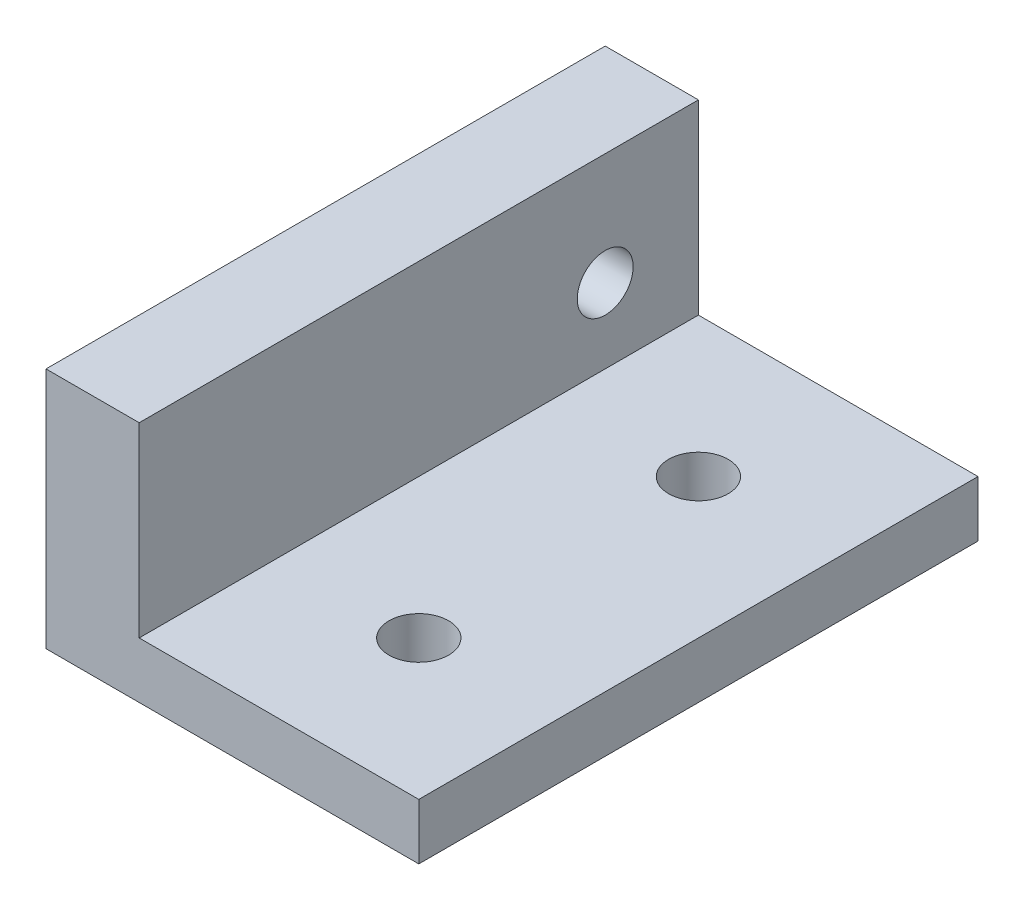
ISO-10303-21;
HEADER;
FILE_DESCRIPTION(('STEP AP214'),'2;1');
FILE_NAME('part.step','',(''),(''),'','','');
FILE_SCHEMA(('AUTOMOTIVE_DESIGN { 1 0 10303 214 1 1 1 1 }'));
ENDSEC;
DATA;
#1=APPLICATION_CONTEXT('core data for automotive mechanical design processes');
#2=APPLICATION_PROTOCOL_DEFINITION('international standard','automotive_design',2000,#1);
#3=PRODUCT_CONTEXT('',#1,'mechanical');
#4=PRODUCT('Part','Part','',(#3));
#5=PRODUCT_RELATED_PRODUCT_CATEGORY('part','',(#4));
#6=PRODUCT_DEFINITION_FORMATION('','',#4);
#7=PRODUCT_DEFINITION_CONTEXT('part definition',#1,'design');
#8=PRODUCT_DEFINITION('design','',#6,#7);
#9=PRODUCT_DEFINITION_SHAPE('','',#8);
#10=(LENGTH_UNIT() NAMED_UNIT(*) SI_UNIT(.MILLI.,.METRE.));
#11=(NAMED_UNIT(*) PLANE_ANGLE_UNIT() SI_UNIT($,.RADIAN.));
#12=(NAMED_UNIT(*) SI_UNIT($,.STERADIAN.) SOLID_ANGLE_UNIT());
#13=UNCERTAINTY_MEASURE_WITH_UNIT(LENGTH_MEASURE(1.E-05),#10,'distance_accuracy_value','');
#14=(GEOMETRIC_REPRESENTATION_CONTEXT(3) GLOBAL_UNCERTAINTY_ASSIGNED_CONTEXT((#13)) GLOBAL_UNIT_ASSIGNED_CONTEXT((#10,
#11,#12)) REPRESENTATION_CONTEXT('',''));
#15=CARTESIAN_POINT('',(0.,0.,0.));
#16=DIRECTION('',(0.,0.,1.));
#17=DIRECTION('',(1.,0.,0.));
#18=AXIS2_PLACEMENT_3D('',#15,#16,#17);
#19=CARTESIAN_POINT('',(10.,3.,-15.));
#20=DIRECTION('',(-1.,0.,0.));
#21=DIRECTION('',(0.,0.,1.));
#22=AXIS2_PLACEMENT_3D('',#19,#20,#21);
#23=PLANE('',#22);
#24=DIRECTION('',(0.,0.,-1.));
#25=VECTOR('',#24,1.);
#26=CARTESIAN_POINT('',(10.,0.,-15.));
#27=LINE('',#26,#25);
#28=CARTESIAN_POINT('',(10.,0.,15.));
#29=VERTEX_POINT('',#28);
#30=CARTESIAN_POINT('',(10.,0.,-15.));
#31=VERTEX_POINT('',#30);
#32=EDGE_CURVE('E100',#29,#31,#27,.T.);
#33=ORIENTED_EDGE('',*,*,#32,.T.);
#34=DIRECTION('',(0.,-1.,0.));
#35=VECTOR('',#34,1.);
#36=CARTESIAN_POINT('',(10.,3.,-15.));
#37=LINE('',#36,#35);
#38=CARTESIAN_POINT('',(10.,3.,-15.));
#39=VERTEX_POINT('',#38);
#40=EDGE_CURVE('E11',#39,#31,#37,.T.);
#41=ORIENTED_EDGE('',*,*,#40,.F.);
#42=DIRECTION('',(0.,0.,-1.));
#43=VECTOR('',#42,1.);
#44=CARTESIAN_POINT('',(10.,3.,-15.));
#45=LINE('',#44,#43);
#46=CARTESIAN_POINT('',(10.,3.,15.));
#47=VERTEX_POINT('',#46);
#48=EDGE_CURVE('E94',#47,#39,#45,.T.);
#49=ORIENTED_EDGE('',*,*,#48,.F.);
#50=DIRECTION('',(0.,-1.,0.));
#51=VECTOR('',#50,1.);
#52=CARTESIAN_POINT('',(10.,3.,15.));
#53=LINE('',#52,#51);
#54=EDGE_CURVE('E85',#47,#29,#53,.T.);
#55=ORIENTED_EDGE('',*,*,#54,.T.);
#56=EDGE_LOOP('',(#33,#41,#49,#55));
#57=FACE_BOUND('',#56,.T.);
#58=ADVANCED_FACE('F41',(#57),#23,.F.);
#59=CARTESIAN_POINT('',(-10.,3.,-15.));
#60=DIRECTION('',(0.,0.,1.));
#61=DIRECTION('',(1.,0.,0.));
#62=AXIS2_PLACEMENT_3D('',#59,#60,#61);
#63=PLANE('',#62);
#64=DIRECTION('',(-1.,0.,0.));
#65=VECTOR('',#64,1.);
#66=CARTESIAN_POINT('',(-10.,0.,-15.));
#67=LINE('',#66,#65);
#68=CARTESIAN_POINT('',(-10.,0.,-15.));
#69=VERTEX_POINT('',#68);
#70=EDGE_CURVE('E104',#31,#69,#67,.T.);
#71=ORIENTED_EDGE('',*,*,#70,.T.);
#72=DIRECTION('',(0.,-1.,0.));
#73=VECTOR('',#72,1.);
#74=CARTESIAN_POINT('',(-10.,3.,-15.));
#75=LINE('',#74,#73);
#76=CARTESIAN_POINT('',(-10.,13.,-15.));
#77=VERTEX_POINT('',#76);
#78=EDGE_CURVE('E50',#77,#69,#75,.T.);
#79=ORIENTED_EDGE('',*,*,#78,.F.);
#80=DIRECTION('',(-1.,0.,0.));
#81=VECTOR('',#80,1.);
#82=CARTESIAN_POINT('',(-10.,13.,-15.));
#83=LINE('',#82,#81);
#84=CARTESIAN_POINT('',(-5.,13.,-15.));
#85=VERTEX_POINT('',#84);
#86=EDGE_CURVE('E135',#85,#77,#83,.T.);
#87=ORIENTED_EDGE('',*,*,#86,.F.);
#88=DIRECTION('',(0.,-1.,0.));
#89=VECTOR('',#88,1.);
#90=CARTESIAN_POINT('',(-5.,13.,-15.));
#91=LINE('',#90,#89);
#92=CARTESIAN_POINT('',(-5.,3.,-15.));
#93=VERTEX_POINT('',#92);
#94=EDGE_CURVE('E112',#85,#93,#91,.T.);
#95=ORIENTED_EDGE('',*,*,#94,.T.);
#96=DIRECTION('',(-1.,0.,0.));
#97=VECTOR('',#96,1.);
#98=CARTESIAN_POINT('',(-10.,3.,-15.));
#99=LINE('',#98,#97);
#100=EDGE_CURVE('E157',#39,#93,#99,.T.);
#101=ORIENTED_EDGE('',*,*,#100,.F.);
#102=ORIENTED_EDGE('',*,*,#40,.T.);
#103=EDGE_LOOP('',(#71,#79,#87,#95,#101,#102));
#104=FACE_BOUND('',#103,.T.);
#105=ADVANCED_FACE('F132',(#104),#63,.F.);
#106=CARTESIAN_POINT('',(-10.,3.,-15.));
#107=DIRECTION('',(1.,0.,0.));
#108=DIRECTION('',(0.,0.,-1.));
#109=AXIS2_PLACEMENT_3D('',#106,#107,#108);
#110=PLANE('',#109);
#111=CARTESIAN_POINT('',(-10.,7.,-10.));
#112=DIRECTION('',(-1.,0.,0.));
#113=DIRECTION('',(0.,0.,1.));
#114=AXIS2_PLACEMENT_3D('',#111,#112,#113);
#115=CIRCLE('',#114,1.5);
#116=CARTESIAN_POINT('',(-10.,7.,-8.49999999999999));
#117=VERTEX_POINT('',#116);
#118=EDGE_CURVE('E173',#117,#117,#115,.T.);
#119=ORIENTED_EDGE('',*,*,#118,.F.);
#120=EDGE_LOOP('',(#119));
#121=FACE_BOUND('',#120,.T.);
#122=DIRECTION('',(0.,0.,1.));
#123=VECTOR('',#122,1.);
#124=CARTESIAN_POINT('',(-10.,0.,-15.));
#125=LINE('',#124,#123);
#126=CARTESIAN_POINT('',(-10.,0.,15.));
#127=VERTEX_POINT('',#126);
#128=EDGE_CURVE('E95',#69,#127,#125,.T.);
#129=ORIENTED_EDGE('',*,*,#128,.T.);
#130=DIRECTION('',(0.,-1.,0.));
#131=VECTOR('',#130,1.);
#132=CARTESIAN_POINT('',(-10.,3.,15.));
#133=LINE('',#132,#131);
#134=CARTESIAN_POINT('',(-10.,13.,15.));
#135=VERTEX_POINT('',#134);
#136=EDGE_CURVE('E89',#135,#127,#133,.T.);
#137=ORIENTED_EDGE('',*,*,#136,.F.);
#138=DIRECTION('',(0.,0.,1.));
#139=VECTOR('',#138,1.);
#140=CARTESIAN_POINT('',(-10.,13.,-15.));
#141=LINE('',#140,#139);
#142=EDGE_CURVE('E128',#77,#135,#141,.T.);
#143=ORIENTED_EDGE('',*,*,#142,.F.);
#144=ORIENTED_EDGE('',*,*,#78,.T.);
#145=EDGE_LOOP('',(#129,#137,#143,#144));
#146=FACE_BOUND('',#145,.T.);
#147=ADVANCED_FACE('F126',(#121,#146),#110,.F.);
#148=CARTESIAN_POINT('',(-10.,3.,15.));
#149=DIRECTION('',(0.,0.,-1.));
#150=DIRECTION('',(-1.,0.,0.));
#151=AXIS2_PLACEMENT_3D('',#148,#149,#150);
#152=PLANE('',#151);
#153=DIRECTION('',(1.,0.,0.));
#154=VECTOR('',#153,1.);
#155=CARTESIAN_POINT('',(-10.,0.,15.));
#156=LINE('',#155,#154);
#157=EDGE_CURVE('E82',#127,#29,#156,.T.);
#158=ORIENTED_EDGE('',*,*,#157,.T.);
#159=ORIENTED_EDGE('',*,*,#54,.F.);
#160=DIRECTION('',(1.,0.,0.));
#161=VECTOR('',#160,1.);
#162=CARTESIAN_POINT('',(-10.,3.,15.));
#163=LINE('',#162,#161);
#164=CARTESIAN_POINT('',(-5.,3.,15.));
#165=VERTEX_POINT('',#164);
#166=EDGE_CURVE('E62',#165,#47,#163,.T.);
#167=ORIENTED_EDGE('',*,*,#166,.F.);
#168=DIRECTION('',(0.,-1.,0.));
#169=VECTOR('',#168,1.);
#170=CARTESIAN_POINT('',(-5.,13.,15.));
#171=LINE('',#170,#169);
#172=CARTESIAN_POINT('',(-5.,13.,15.));
#173=VERTEX_POINT('',#172);
#174=EDGE_CURVE('E106',#173,#165,#171,.T.);
#175=ORIENTED_EDGE('',*,*,#174,.F.);
#176=DIRECTION('',(1.,0.,0.));
#177=VECTOR('',#176,1.);
#178=CARTESIAN_POINT('',(-10.,13.,15.));
#179=LINE('',#178,#177);
#180=EDGE_CURVE('E150',#135,#173,#179,.T.);
#181=ORIENTED_EDGE('',*,*,#180,.F.);
#182=ORIENTED_EDGE('',*,*,#136,.T.);
#183=EDGE_LOOP('',(#158,#159,#167,#175,#181,#182));
#184=FACE_BOUND('',#183,.T.);
#185=ADVANCED_FACE('F84',(#184),#152,.F.);
#186=CARTESIAN_POINT('',(0.,3.,0.));
#187=DIRECTION('',(0.,1.,0.));
#188=DIRECTION('',(0.,0.,1.));
#189=AXIS2_PLACEMENT_3D('',#186,#187,#188);
#190=PLANE('',#189);
#191=CARTESIAN_POINT('',(2.5,3.,7.5));
#192=DIRECTION('',(0.,1.,0.));
#193=DIRECTION('',(0.,0.,1.));
#194=AXIS2_PLACEMENT_3D('',#191,#192,#193);
#195=CIRCLE('',#194,1.6);
#196=CARTESIAN_POINT('',(2.5,3.,9.1));
#197=VERTEX_POINT('',#196);
#198=EDGE_CURVE('E186',#197,#197,#195,.T.);
#199=ORIENTED_EDGE('',*,*,#198,.F.);
#200=EDGE_LOOP('',(#199));
#201=FACE_BOUND('',#200,.T.);
#202=CARTESIAN_POINT('',(2.5,3.,-7.5));
#203=DIRECTION('',(0.,1.,0.));
#204=DIRECTION('',(0.,0.,1.));
#205=AXIS2_PLACEMENT_3D('',#202,#203,#204);
#206=CIRCLE('',#205,1.6);
#207=CARTESIAN_POINT('',(2.5,3.,-5.9));
#208=VERTEX_POINT('',#207);
#209=EDGE_CURVE('E178',#208,#208,#206,.T.);
#210=ORIENTED_EDGE('',*,*,#209,.F.);
#211=EDGE_LOOP('',(#210));
#212=FACE_BOUND('',#211,.T.);
#213=DIRECTION('',(0.,0.,-1.));
#214=VECTOR('',#213,1.);
#215=CARTESIAN_POINT('',(-5.,3.,-15.));
#216=LINE('',#215,#214);
#217=EDGE_CURVE('E57',#165,#93,#216,.T.);
#218=ORIENTED_EDGE('',*,*,#217,.F.);
#219=ORIENTED_EDGE('',*,*,#166,.T.);
#220=ORIENTED_EDGE('',*,*,#48,.T.);
#221=ORIENTED_EDGE('',*,*,#100,.T.);
#222=EDGE_LOOP('',(#218,#219,#220,#221));
#223=FACE_BOUND('',#222,.T.);
#224=ADVANCED_FACE('F161',(#201,#212,#223),#190,.T.);
#225=CARTESIAN_POINT('',(0.,0.,0.));
#226=DIRECTION('',(0.,1.,0.));
#227=DIRECTION('',(0.,0.,1.));
#228=AXIS2_PLACEMENT_3D('',#225,#226,#227);
#229=PLANE('',#228);
#230=CARTESIAN_POINT('',(2.5,0.,7.5));
#231=DIRECTION('',(0.,1.,0.));
#232=DIRECTION('',(0.,0.,1.));
#233=AXIS2_PLACEMENT_3D('',#230,#231,#232);
#234=CIRCLE('',#233,1.6);
#235=CARTESIAN_POINT('',(2.5,0.,9.1));
#236=VERTEX_POINT('',#235);
#237=EDGE_CURVE('E177',#236,#236,#234,.T.);
#238=ORIENTED_EDGE('',*,*,#237,.T.);
#239=EDGE_LOOP('',(#238));
#240=FACE_BOUND('',#239,.T.);
#241=CARTESIAN_POINT('',(2.5,0.,-7.5));
#242=DIRECTION('',(0.,1.,0.));
#243=DIRECTION('',(0.,0.,1.));
#244=AXIS2_PLACEMENT_3D('',#241,#242,#243);
#245=CIRCLE('',#244,1.6);
#246=CARTESIAN_POINT('',(2.5,0.,-5.9));
#247=VERTEX_POINT('',#246);
#248=EDGE_CURVE('E182',#247,#247,#245,.T.);
#249=ORIENTED_EDGE('',*,*,#248,.T.);
#250=EDGE_LOOP('',(#249));
#251=FACE_BOUND('',#250,.T.);
#252=ORIENTED_EDGE('',*,*,#32,.F.);
#253=ORIENTED_EDGE('',*,*,#157,.F.);
#254=ORIENTED_EDGE('',*,*,#128,.F.);
#255=ORIENTED_EDGE('',*,*,#70,.F.);
#256=EDGE_LOOP('',(#252,#253,#254,#255));
#257=FACE_BOUND('',#256,.T.);
#258=ADVANCED_FACE('F103',(#240,#251,#257),#229,.F.);
#259=CARTESIAN_POINT('',(-5.,13.,-15.));
#260=DIRECTION('',(-1.,0.,0.));
#261=DIRECTION('',(0.,0.,1.));
#262=AXIS2_PLACEMENT_3D('',#259,#260,#261);
#263=PLANE('',#262);
#264=CARTESIAN_POINT('',(-5.,7.,-10.));
#265=DIRECTION('',(-1.,0.,0.));
#266=DIRECTION('',(0.,0.,1.));
#267=AXIS2_PLACEMENT_3D('',#264,#265,#266);
#268=CIRCLE('',#267,1.5);
#269=CARTESIAN_POINT('',(-5.,7.,-8.49999999999999));
#270=VERTEX_POINT('',#269);
#271=EDGE_CURVE('E44',#270,#270,#268,.T.);
#272=ORIENTED_EDGE('',*,*,#271,.T.);
#273=EDGE_LOOP('',(#272));
#274=FACE_BOUND('',#273,.T.);
#275=ORIENTED_EDGE('',*,*,#217,.T.);
#276=ORIENTED_EDGE('',*,*,#94,.F.);
#277=DIRECTION('',(0.,0.,-1.));
#278=VECTOR('',#277,1.);
#279=CARTESIAN_POINT('',(-5.,13.,-15.));
#280=LINE('',#279,#278);
#281=EDGE_CURVE('E143',#173,#85,#280,.T.);
#282=ORIENTED_EDGE('',*,*,#281,.F.);
#283=ORIENTED_EDGE('',*,*,#174,.T.);
#284=EDGE_LOOP('',(#275,#276,#282,#283));
#285=FACE_BOUND('',#284,.T.);
#286=ADVANCED_FACE('F163',(#274,#285),#263,.F.);
#287=CARTESIAN_POINT('',(0.,13.,0.));
#288=DIRECTION('',(0.,1.,0.));
#289=DIRECTION('',(0.,0.,1.));
#290=AXIS2_PLACEMENT_3D('',#287,#288,#289);
#291=PLANE('',#290);
#292=ORIENTED_EDGE('',*,*,#142,.T.);
#293=ORIENTED_EDGE('',*,*,#180,.T.);
#294=ORIENTED_EDGE('',*,*,#281,.T.);
#295=ORIENTED_EDGE('',*,*,#86,.T.);
#296=EDGE_LOOP('',(#292,#293,#294,#295));
#297=FACE_BOUND('',#296,.T.);
#298=ADVANCED_FACE('F139',(#297),#291,.T.);
#299=CARTESIAN_POINT('',(0.,7.,-10.));
#300=DIRECTION('',(-1.,0.,0.));
#301=DIRECTION('',(0.,0.,1.));
#302=AXIS2_PLACEMENT_3D('',#299,#300,#301);
#303=CYLINDRICAL_SURFACE('',#302,1.5);
#304=ORIENTED_EDGE('',*,*,#118,.T.);
#305=EDGE_LOOP('',(#304));
#306=FACE_BOUND('',#305,.T.);
#307=ORIENTED_EDGE('',*,*,#271,.F.);
#308=EDGE_LOOP('',(#307));
#309=FACE_BOUND('',#308,.T.);
#310=ADVANCED_FACE('F209',(#306,#309),#303,.F.);
#311=CARTESIAN_POINT('',(2.5,0.,-7.5));
#312=DIRECTION('',(0.,1.,0.));
#313=DIRECTION('',(0.,0.,1.));
#314=AXIS2_PLACEMENT_3D('',#311,#312,#313);
#315=CYLINDRICAL_SURFACE('',#314,1.6);
#316=ORIENTED_EDGE('',*,*,#248,.F.);
#317=EDGE_LOOP('',(#316));
#318=FACE_BOUND('',#317,.T.);
#319=ORIENTED_EDGE('',*,*,#209,.T.);
#320=EDGE_LOOP('',(#319));
#321=FACE_BOUND('',#320,.T.);
#322=ADVANCED_FACE('F199',(#318,#321),#315,.F.);
#323=CARTESIAN_POINT('',(2.5,0.,7.5));
#324=DIRECTION('',(0.,1.,0.));
#325=DIRECTION('',(0.,0.,1.));
#326=AXIS2_PLACEMENT_3D('',#323,#324,#325);
#327=CYLINDRICAL_SURFACE('',#326,1.6);
#328=ORIENTED_EDGE('',*,*,#237,.F.);
#329=EDGE_LOOP('',(#328));
#330=FACE_BOUND('',#329,.T.);
#331=ORIENTED_EDGE('',*,*,#198,.T.);
#332=EDGE_LOOP('',(#331));
#333=FACE_BOUND('',#332,.T.);
#334=ADVANCED_FACE('F196',(#330,#333),#327,.F.);
#335=CLOSED_SHELL('',(#58,#105,#147,#185,#224,#258,#286,#298,#310,#322,#334));
#336=MANIFOLD_SOLID_BREP('B2',#335);
#337=ADVANCED_BREP_SHAPE_REPRESENTATION('',(#18,#336),#14);
#338=SHAPE_DEFINITION_REPRESENTATION(#9,#337);
ENDSEC;
END-ISO-10303-21;
